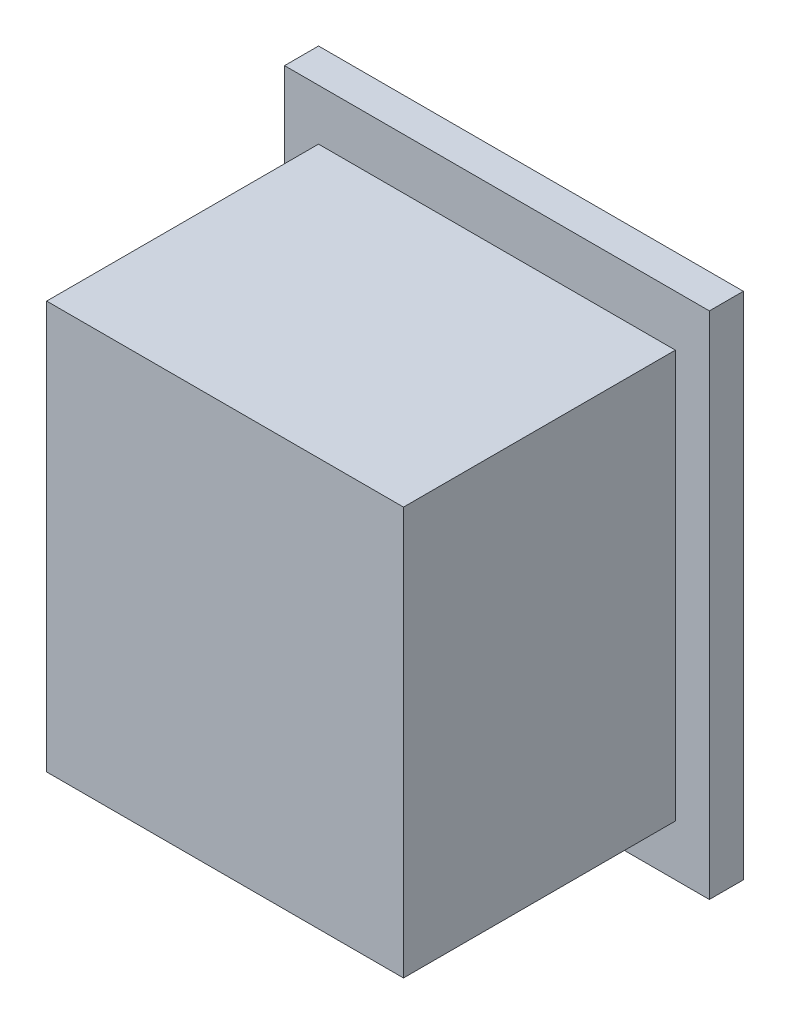
ISO-10303-21;
HEADER;
FILE_DESCRIPTION(('STEP AP214'),'2;1');
FILE_NAME('part.step','',(''),(''),'','','');
FILE_SCHEMA(('AUTOMOTIVE_DESIGN { 1 0 10303 214 1 1 1 1 }'));
ENDSEC;
DATA;
#1=APPLICATION_CONTEXT('core data for automotive mechanical design processes');
#2=APPLICATION_PROTOCOL_DEFINITION('international standard','automotive_design',2000,#1);
#3=PRODUCT_CONTEXT('',#1,'mechanical');
#4=PRODUCT('Part','Part','',(#3));
#5=PRODUCT_RELATED_PRODUCT_CATEGORY('part','',(#4));
#6=PRODUCT_DEFINITION_FORMATION('','',#4);
#7=PRODUCT_DEFINITION_CONTEXT('part definition',#1,'design');
#8=PRODUCT_DEFINITION('design','',#6,#7);
#9=PRODUCT_DEFINITION_SHAPE('','',#8);
#10=(LENGTH_UNIT() NAMED_UNIT(*) SI_UNIT(.MILLI.,.METRE.));
#11=(NAMED_UNIT(*) PLANE_ANGLE_UNIT() SI_UNIT($,.RADIAN.));
#12=(NAMED_UNIT(*) SI_UNIT($,.STERADIAN.) SOLID_ANGLE_UNIT());
#13=UNCERTAINTY_MEASURE_WITH_UNIT(LENGTH_MEASURE(1.E-05),#10,'distance_accuracy_value','');
#14=(GEOMETRIC_REPRESENTATION_CONTEXT(3) GLOBAL_UNCERTAINTY_ASSIGNED_CONTEXT((#13)) GLOBAL_UNIT_ASSIGNED_CONTEXT((#10,
#11,#12)) REPRESENTATION_CONTEXT('',''));
#15=CARTESIAN_POINT('',(0.,0.,0.));
#16=DIRECTION('',(0.,0.,1.));
#17=DIRECTION('',(1.,0.,0.));
#18=AXIS2_PLACEMENT_3D('',#15,#16,#17);
#19=CARTESIAN_POINT('',(-12.5825242718446,13.1650485436893,16.));
#20=DIRECTION('',(1.,0.,0.));
#21=DIRECTION('',(0.,0.,-1.));
#22=AXIS2_PLACEMENT_3D('',#19,#20,#21);
#23=PLANE('',#22);
#24=DIRECTION('',(0.,-1.,0.));
#25=VECTOR('',#24,1.);
#26=CARTESIAN_POINT('',(-12.5825242718446,13.1650485436893,0.));
#27=LINE('',#26,#25);
#28=CARTESIAN_POINT('',(-12.5825242718446,13.1650485436893,0.));
#29=VERTEX_POINT('',#28);
#30=CARTESIAN_POINT('',(-12.5825242718446,-10.8349514563107,0.));
#31=VERTEX_POINT('',#30);
#32=EDGE_CURVE('E117',#29,#31,#27,.T.);
#33=ORIENTED_EDGE('',*,*,#32,.T.);
#34=DIRECTION('',(0.,0.,-1.));
#35=VECTOR('',#34,1.);
#36=CARTESIAN_POINT('',(-12.5825242718446,-10.8349514563107,16.));
#37=LINE('',#36,#35);
#38=CARTESIAN_POINT('',(-12.5825242718446,-10.8349514563107,16.));
#39=VERTEX_POINT('',#38);
#40=EDGE_CURVE('E11',#39,#31,#37,.T.);
#41=ORIENTED_EDGE('',*,*,#40,.F.);
#42=DIRECTION('',(0.,-1.,0.));
#43=VECTOR('',#42,1.);
#44=CARTESIAN_POINT('',(-12.5825242718446,13.1650485436893,16.));
#45=LINE('',#44,#43);
#46=CARTESIAN_POINT('',(-12.5825242718446,13.1650485436893,16.));
#47=VERTEX_POINT('',#46);
#48=EDGE_CURVE('E126',#47,#39,#45,.T.);
#49=ORIENTED_EDGE('',*,*,#48,.F.);
#50=DIRECTION('',(0.,0.,-1.));
#51=VECTOR('',#50,1.);
#52=CARTESIAN_POINT('',(-12.5825242718446,13.1650485436893,16.));
#53=LINE('',#52,#51);
#54=EDGE_CURVE('E133',#47,#29,#53,.T.);
#55=ORIENTED_EDGE('',*,*,#54,.T.);
#56=EDGE_LOOP('',(#33,#41,#49,#55));
#57=FACE_BOUND('',#56,.T.);
#58=ADVANCED_FACE('F32',(#57),#23,.F.);
#59=CARTESIAN_POINT('',(-12.5825242718446,-10.8349514563107,16.));
#60=DIRECTION('',(0.,1.,0.));
#61=DIRECTION('',(0.,0.,1.));
#62=AXIS2_PLACEMENT_3D('',#59,#60,#61);
#63=PLANE('',#62);
#64=DIRECTION('',(1.,0.,0.));
#65=VECTOR('',#64,1.);
#66=CARTESIAN_POINT('',(-12.5825242718446,-10.8349514563107,0.));
#67=LINE('',#66,#65);
#68=CARTESIAN_POINT('',(8.41747572815537,-10.8349514563107,0.));
#69=VERTEX_POINT('',#68);
#70=EDGE_CURVE('E120',#31,#69,#67,.T.);
#71=ORIENTED_EDGE('',*,*,#70,.T.);
#72=DIRECTION('',(0.,0.,-1.));
#73=VECTOR('',#72,1.);
#74=CARTESIAN_POINT('',(8.41747572815537,-10.8349514563107,16.));
#75=LINE('',#74,#73);
#76=CARTESIAN_POINT('',(8.41747572815537,-10.8349514563107,16.));
#77=VERTEX_POINT('',#76);
#78=EDGE_CURVE('E40',#77,#69,#75,.T.);
#79=ORIENTED_EDGE('',*,*,#78,.F.);
#80=DIRECTION('',(1.,0.,0.));
#81=VECTOR('',#80,1.);
#82=CARTESIAN_POINT('',(-12.5825242718446,-10.8349514563107,16.));
#83=LINE('',#82,#81);
#84=EDGE_CURVE('E128',#39,#77,#83,.T.);
#85=ORIENTED_EDGE('',*,*,#84,.F.);
#86=ORIENTED_EDGE('',*,*,#40,.T.);
#87=EDGE_LOOP('',(#71,#79,#85,#86));
#88=FACE_BOUND('',#87,.T.);
#89=ADVANCED_FACE('F154',(#88),#63,.F.);
#90=CARTESIAN_POINT('',(8.41747572815536,13.1650485436893,16.));
#91=DIRECTION('',(-1.,0.,0.));
#92=DIRECTION('',(0.,-1.,0.));
#93=AXIS2_PLACEMENT_3D('',#90,#91,#92);
#94=PLANE('',#93);
#95=DIRECTION('',(0.,1.,0.));
#96=VECTOR('',#95,1.);
#97=CARTESIAN_POINT('',(8.41747572815536,13.1650485436893,0.));
#98=LINE('',#97,#96);
#99=CARTESIAN_POINT('',(8.41747572815536,13.1650485436893,0.));
#100=VERTEX_POINT('',#99);
#101=EDGE_CURVE('E137',#69,#100,#98,.T.);
#102=ORIENTED_EDGE('',*,*,#101,.T.);
#103=DIRECTION('',(0.,0.,-1.));
#104=VECTOR('',#103,1.);
#105=CARTESIAN_POINT('',(8.41747572815536,13.1650485436893,16.));
#106=LINE('',#105,#104);
#107=CARTESIAN_POINT('',(8.41747572815536,13.1650485436893,16.));
#108=VERTEX_POINT('',#107);
#109=EDGE_CURVE('E144',#108,#100,#106,.T.);
#110=ORIENTED_EDGE('',*,*,#109,.F.);
#111=DIRECTION('',(0.,1.,0.));
#112=VECTOR('',#111,1.);
#113=CARTESIAN_POINT('',(8.41747572815536,13.1650485436893,16.));
#114=LINE('',#113,#112);
#115=EDGE_CURVE('E131',#77,#108,#114,.T.);
#116=ORIENTED_EDGE('',*,*,#115,.F.);
#117=ORIENTED_EDGE('',*,*,#78,.T.);
#118=EDGE_LOOP('',(#102,#110,#116,#117));
#119=FACE_BOUND('',#118,.T.);
#120=ADVANCED_FACE('F150',(#119),#94,.F.);
#121=CARTESIAN_POINT('',(-12.5825242718446,13.1650485436893,16.));
#122=DIRECTION('',(0.,-1.,0.));
#123=DIRECTION('',(0.,0.,-1.));
#124=AXIS2_PLACEMENT_3D('',#121,#122,#123);
#125=PLANE('',#124);
#126=DIRECTION('',(-1.,0.,0.));
#127=VECTOR('',#126,1.);
#128=CARTESIAN_POINT('',(-12.5825242718446,13.1650485436893,0.));
#129=LINE('',#128,#127);
#130=EDGE_CURVE('E129',#100,#29,#129,.T.);
#131=ORIENTED_EDGE('',*,*,#130,.T.);
#132=ORIENTED_EDGE('',*,*,#54,.F.);
#133=DIRECTION('',(-1.,0.,0.));
#134=VECTOR('',#133,1.);
#135=CARTESIAN_POINT('',(-12.5825242718446,13.1650485436893,16.));
#136=LINE('',#135,#134);
#137=EDGE_CURVE('E47',#108,#47,#136,.T.);
#138=ORIENTED_EDGE('',*,*,#137,.F.);
#139=ORIENTED_EDGE('',*,*,#109,.T.);
#140=EDGE_LOOP('',(#131,#132,#138,#139));
#141=FACE_BOUND('',#140,.T.);
#142=ADVANCED_FACE('F160',(#141),#125,.F.);
#143=CARTESIAN_POINT('',(0.,0.,16.));
#144=DIRECTION('',(0.,0.,1.));
#145=DIRECTION('',(1.,0.,0.));
#146=AXIS2_PLACEMENT_3D('',#143,#144,#145);
#147=PLANE('',#146);
#148=ORIENTED_EDGE('',*,*,#48,.T.);
#149=ORIENTED_EDGE('',*,*,#84,.T.);
#150=ORIENTED_EDGE('',*,*,#115,.T.);
#151=ORIENTED_EDGE('',*,*,#137,.T.);
#152=EDGE_LOOP('',(#148,#149,#150,#151));
#153=FACE_BOUND('',#152,.T.);
#154=ADVANCED_FACE('F163',(#153),#147,.T.);
#155=CARTESIAN_POINT('',(-14.5825242718446,-13.8349514563107,-2.));
#156=DIRECTION('',(1.,0.,0.));
#157=DIRECTION('',(0.,0.,-1.));
#158=AXIS2_PLACEMENT_3D('',#155,#156,#157);
#159=PLANE('',#158);
#160=DIRECTION('',(0.,1.,0.));
#161=VECTOR('',#160,1.);
#162=CARTESIAN_POINT('',(-14.5825242718446,-13.8349514563107,0.));
#163=LINE('',#162,#161);
#164=CARTESIAN_POINT('',(-14.5825242718446,-13.8349514563107,0.));
#165=VERTEX_POINT('',#164);
#166=CARTESIAN_POINT('',(-14.5825242718446,16.1650485436893,0.));
#167=VERTEX_POINT('',#166);
#168=EDGE_CURVE('E116',#165,#167,#163,.T.);
#169=ORIENTED_EDGE('',*,*,#168,.T.);
#170=DIRECTION('',(0.,0.,1.));
#171=VECTOR('',#170,1.);
#172=CARTESIAN_POINT('',(-14.5825242718446,16.1650485436893,-2.));
#173=LINE('',#172,#171);
#174=CARTESIAN_POINT('',(-14.5825242718446,16.1650485436893,-2.));
#175=VERTEX_POINT('',#174);
#176=EDGE_CURVE('E96',#175,#167,#173,.T.);
#177=ORIENTED_EDGE('',*,*,#176,.F.);
#178=DIRECTION('',(0.,1.,0.));
#179=VECTOR('',#178,1.);
#180=CARTESIAN_POINT('',(-14.5825242718446,-13.8349514563107,-2.));
#181=LINE('',#180,#179);
#182=CARTESIAN_POINT('',(-14.5825242718446,-13.8349514563107,-2.));
#183=VERTEX_POINT('',#182);
#184=EDGE_CURVE('E103',#183,#175,#181,.T.);
#185=ORIENTED_EDGE('',*,*,#184,.F.);
#186=DIRECTION('',(0.,0.,1.));
#187=VECTOR('',#186,1.);
#188=CARTESIAN_POINT('',(-14.5825242718446,-13.8349514563107,-2.));
#189=LINE('',#188,#187);
#190=EDGE_CURVE('E243',#183,#165,#189,.T.);
#191=ORIENTED_EDGE('',*,*,#190,.T.);
#192=EDGE_LOOP('',(#169,#177,#185,#191));
#193=FACE_BOUND('',#192,.T.);
#194=ADVANCED_FACE('F114',(#193),#159,.F.);
#195=CARTESIAN_POINT('',(-14.5825242718446,16.1650485436893,-2.));
#196=DIRECTION('',(0.,-1.,0.));
#197=DIRECTION('',(1.,0.,0.));
#198=AXIS2_PLACEMENT_3D('',#195,#196,#197);
#199=PLANE('',#198);
#200=DIRECTION('',(1.,0.,0.));
#201=VECTOR('',#200,1.);
#202=CARTESIAN_POINT('',(-14.5825242718446,16.1650485436893,0.));
#203=LINE('',#202,#201);
#204=CARTESIAN_POINT('',(10.4174757281554,16.1650485436893,0.));
#205=VERTEX_POINT('',#204);
#206=EDGE_CURVE('E249',#167,#205,#203,.T.);
#207=ORIENTED_EDGE('',*,*,#206,.T.);
#208=DIRECTION('',(0.,0.,1.));
#209=VECTOR('',#208,1.);
#210=CARTESIAN_POINT('',(10.4174757281554,16.1650485436893,-2.));
#211=LINE('',#210,#209);
#212=CARTESIAN_POINT('',(10.4174757281554,16.1650485436893,-2.));
#213=VERTEX_POINT('',#212);
#214=EDGE_CURVE('E99',#213,#205,#211,.T.);
#215=ORIENTED_EDGE('',*,*,#214,.F.);
#216=DIRECTION('',(1.,0.,0.));
#217=VECTOR('',#216,1.);
#218=CARTESIAN_POINT('',(-14.5825242718446,16.1650485436893,-2.));
#219=LINE('',#218,#217);
#220=EDGE_CURVE('E92',#175,#213,#219,.T.);
#221=ORIENTED_EDGE('',*,*,#220,.F.);
#222=ORIENTED_EDGE('',*,*,#176,.T.);
#223=EDGE_LOOP('',(#207,#215,#221,#222));
#224=FACE_BOUND('',#223,.T.);
#225=ADVANCED_FACE('F94',(#224),#199,.F.);
#226=CARTESIAN_POINT('',(10.4174757281554,16.1650485436893,-2.));
#227=DIRECTION('',(-1.,0.,0.));
#228=DIRECTION('',(0.,-1.,0.));
#229=AXIS2_PLACEMENT_3D('',#226,#227,#228);
#230=PLANE('',#229);
#231=DIRECTION('',(0.,-1.,0.));
#232=VECTOR('',#231,1.);
#233=CARTESIAN_POINT('',(10.4174757281554,16.1650485436893,0.));
#234=LINE('',#233,#232);
#235=CARTESIAN_POINT('',(10.4174757281554,-13.8349514563107,0.));
#236=VERTEX_POINT('',#235);
#237=EDGE_CURVE('E246',#205,#236,#234,.T.);
#238=ORIENTED_EDGE('',*,*,#237,.T.);
#239=DIRECTION('',(0.,0.,1.));
#240=VECTOR('',#239,1.);
#241=CARTESIAN_POINT('',(10.4174757281554,-13.8349514563107,-2.));
#242=LINE('',#241,#240);
#243=CARTESIAN_POINT('',(10.4174757281554,-13.8349514563107,-2.));
#244=VERTEX_POINT('',#243);
#245=EDGE_CURVE('E122',#244,#236,#242,.T.);
#246=ORIENTED_EDGE('',*,*,#245,.F.);
#247=DIRECTION('',(0.,-1.,0.));
#248=VECTOR('',#247,1.);
#249=CARTESIAN_POINT('',(10.4174757281554,16.1650485436893,-2.));
#250=LINE('',#249,#248);
#251=EDGE_CURVE('E102',#213,#244,#250,.T.);
#252=ORIENTED_EDGE('',*,*,#251,.F.);
#253=ORIENTED_EDGE('',*,*,#214,.T.);
#254=EDGE_LOOP('',(#238,#246,#252,#253));
#255=FACE_BOUND('',#254,.T.);
#256=ADVANCED_FACE('F202',(#255),#230,.F.);
#257=CARTESIAN_POINT('',(10.4174757281554,-13.8349514563107,-2.));
#258=DIRECTION('',(0.,1.,0.));
#259=DIRECTION('',(0.,0.,1.));
#260=AXIS2_PLACEMENT_3D('',#257,#258,#259);
#261=PLANE('',#260);
#262=DIRECTION('',(-1.,0.,0.));
#263=VECTOR('',#262,1.);
#264=CARTESIAN_POINT('',(10.4174757281554,-13.8349514563107,0.));
#265=LINE('',#264,#263);
#266=EDGE_CURVE('E112',#236,#165,#265,.T.);
#267=ORIENTED_EDGE('',*,*,#266,.T.);
#268=ORIENTED_EDGE('',*,*,#190,.F.);
#269=DIRECTION('',(-1.,0.,0.));
#270=VECTOR('',#269,1.);
#271=CARTESIAN_POINT('',(10.4174757281554,-13.8349514563107,-2.));
#272=LINE('',#271,#270);
#273=EDGE_CURVE('E108',#244,#183,#272,.T.);
#274=ORIENTED_EDGE('',*,*,#273,.F.);
#275=ORIENTED_EDGE('',*,*,#245,.T.);
#276=EDGE_LOOP('',(#267,#268,#274,#275));
#277=FACE_BOUND('',#276,.T.);
#278=ADVANCED_FACE('F211',(#277),#261,.F.);
#279=CARTESIAN_POINT('',(0.,0.,-2.));
#280=DIRECTION('',(0.,0.,-1.));
#281=DIRECTION('',(-1.,0.,0.));
#282=AXIS2_PLACEMENT_3D('',#279,#280,#281);
#283=PLANE('',#282);
#284=ORIENTED_EDGE('',*,*,#184,.T.);
#285=ORIENTED_EDGE('',*,*,#220,.T.);
#286=ORIENTED_EDGE('',*,*,#251,.T.);
#287=ORIENTED_EDGE('',*,*,#273,.T.);
#288=EDGE_LOOP('',(#284,#285,#286,#287));
#289=FACE_BOUND('',#288,.T.);
#290=ADVANCED_FACE('F106',(#289),#283,.T.);
#291=CARTESIAN_POINT('',(0.,0.,0.));
#292=DIRECTION('',(0.,0.,-1.));
#293=DIRECTION('',(-1.,0.,0.));
#294=AXIS2_PLACEMENT_3D('',#291,#292,#293);
#295=PLANE('',#294);
#296=ORIENTED_EDGE('',*,*,#32,.F.);
#297=ORIENTED_EDGE('',*,*,#130,.F.);
#298=ORIENTED_EDGE('',*,*,#101,.F.);
#299=ORIENTED_EDGE('',*,*,#70,.F.);
#300=EDGE_LOOP('',(#296,#297,#298,#299));
#301=FACE_BOUND('',#300,.T.);
#302=ORIENTED_EDGE('',*,*,#168,.F.);
#303=ORIENTED_EDGE('',*,*,#266,.F.);
#304=ORIENTED_EDGE('',*,*,#237,.F.);
#305=ORIENTED_EDGE('',*,*,#206,.F.);
#306=EDGE_LOOP('',(#302,#303,#304,#305));
#307=FACE_BOUND('',#306,.T.);
#308=ADVANCED_FACE('F157',(#301,#307),#295,.F.);
#309=CLOSED_SHELL('',(#58,#89,#120,#142,#154,#194,#225,#256,#278,#290,#308));
#310=MANIFOLD_SOLID_BREP('B2',#309);
#311=ADVANCED_BREP_SHAPE_REPRESENTATION('',(#18,#310),#14);
#312=SHAPE_DEFINITION_REPRESENTATION(#9,#311);
ENDSEC;
END-ISO-10303-21;
